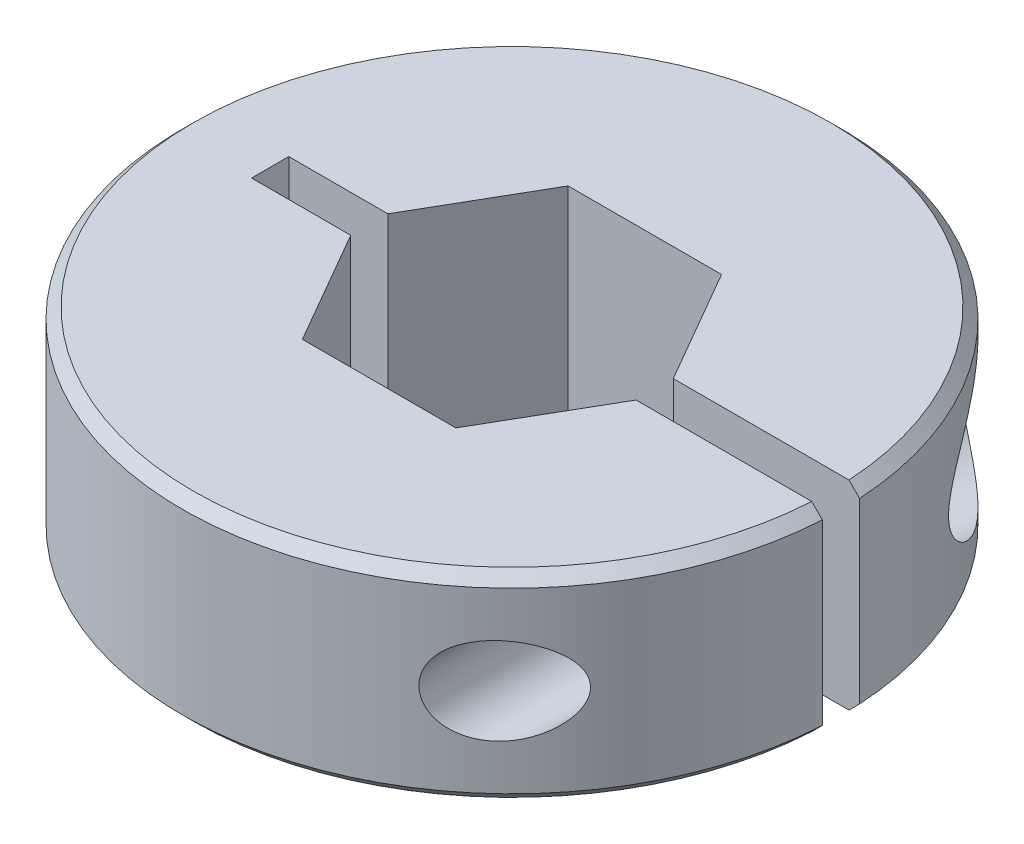
ISO-10303-21;
HEADER;
FILE_DESCRIPTION(('STEP AP214'),'2;1');
FILE_NAME('part.step','',(''),(''),'','','');
FILE_SCHEMA(('AUTOMOTIVE_DESIGN { 1 0 10303 214 1 1 1 1 }'));
ENDSEC;
DATA;
#1=APPLICATION_CONTEXT('core data for automotive mechanical design processes');
#2=APPLICATION_PROTOCOL_DEFINITION('international standard','automotive_design',2000,#1);
#3=PRODUCT_CONTEXT('',#1,'mechanical');
#4=PRODUCT('Part','Part','',(#3));
#5=PRODUCT_RELATED_PRODUCT_CATEGORY('part','',(#4));
#6=PRODUCT_DEFINITION_FORMATION('','',#4);
#7=PRODUCT_DEFINITION_CONTEXT('part definition',#1,'design');
#8=PRODUCT_DEFINITION('design','',#6,#7);
#9=PRODUCT_DEFINITION_SHAPE('','',#8);
#10=(LENGTH_UNIT() NAMED_UNIT(*) SI_UNIT(.MILLI.,.METRE.));
#11=(NAMED_UNIT(*) PLANE_ANGLE_UNIT() SI_UNIT($,.RADIAN.));
#12=(NAMED_UNIT(*) SI_UNIT($,.STERADIAN.) SOLID_ANGLE_UNIT());
#13=UNCERTAINTY_MEASURE_WITH_UNIT(LENGTH_MEASURE(1.E-05),#10,'distance_accuracy_value','');
#14=(GEOMETRIC_REPRESENTATION_CONTEXT(3) GLOBAL_UNCERTAINTY_ASSIGNED_CONTEXT((#13)) GLOBAL_UNIT_ASSIGNED_CONTEXT((#10,
#11,#12)) REPRESENTATION_CONTEXT('',''));
#15=CARTESIAN_POINT('',(0.,0.,0.));
#16=DIRECTION('',(0.,0.,1.));
#17=DIRECTION('',(1.,0.,0.));
#18=AXIS2_PLACEMENT_3D('',#15,#16,#17);
#19=CARTESIAN_POINT('',(10.7698872348561,4.7625,-4.95299999999999));
#20=DIRECTION('',(0.,0.,-1.));
#21=DIRECTION('',(-1.,0.,0.));
#22=AXIS2_PLACEMENT_3D('',#19,#20,#21);
#23=PLANE('',#22);
#24=CARTESIAN_POINT('',(10.7698872348561,4.7625,-4.95299999999999));
#25=DIRECTION('',(0.,0.,-1.));
#26=DIRECTION('',(-1.,0.,0.));
#27=AXIS2_PLACEMENT_3D('',#24,#25,#26);
#28=CIRCLE('',#27,2.0828);
#29=CARTESIAN_POINT('',(8.68708723485608,4.7625,-4.95299999999999));
#30=VERTEX_POINT('',#29);
#31=EDGE_CURVE('E366',#30,#30,#28,.F.);
#32=ORIENTED_EDGE('',*,*,#31,.T.);
#33=EDGE_LOOP('',(#32));
#34=FACE_BOUND('',#33,.T.);
#35=CARTESIAN_POINT('',(10.7698872348561,4.7625,-4.95299999999999));
#36=DIRECTION('',(0.,0.,-1.));
#37=DIRECTION('',(-1.,0.,0.));
#38=AXIS2_PLACEMENT_3D('',#35,#36,#37);
#39=CIRCLE('',#38,3.556);
#40=CARTESIAN_POINT('',(7.21388723485608,4.7625,-4.95299999999999));
#41=VERTEX_POINT('',#40);
#42=EDGE_CURVE('E18',#41,#41,#39,.T.);
#43=ORIENTED_EDGE('',*,*,#42,.T.);
#44=EDGE_LOOP('',(#43));
#45=FACE_BOUND('',#44,.T.);
#46=ADVANCED_FACE('F15',(#34,#45),#23,.T.);
#47=CARTESIAN_POINT('',(10.7698872348561,4.7625,-4.95299999999999));
#48=DIRECTION('',(0.,0.,-1.));
#49=DIRECTION('',(-1.,0.,0.));
#50=AXIS2_PLACEMENT_3D('',#47,#48,#49);
#51=CYLINDRICAL_SURFACE('',#50,3.556);
#52=ORIENTED_EDGE('',*,*,#42,.F.);
#53=EDGE_LOOP('',(#52));
#54=FACE_BOUND('',#53,.T.);
#55=CARTESIAN_POINT('',(14.3258872348561,4.7625,-6.53975985294472));
#56=CARTESIAN_POINT('',(14.3258802101327,4.85634541160308,-6.53977781823287));
#57=CARTESIAN_POINT('',(14.3221232292471,4.95030424142506,-6.54802444220115));
#58=CARTESIAN_POINT('',(14.3075403854795,5.13506724589043,-6.57982295084788));
#59=CARTESIAN_POINT('',(14.2966980026111,5.2258635244787,-6.60341060332637));
#60=CARTESIAN_POINT('',(14.2648298906135,5.42884942033144,-6.67202634115798));
#61=CARTESIAN_POINT('',(14.241717582217,5.53921812985933,-6.72137830213928));
#62=CARTESIAN_POINT('',(14.1877311128915,5.75013258396645,-6.83459686835309));
#63=CARTESIAN_POINT('',(14.1568374848652,5.85065280047014,-6.89849983784821));
#64=CARTESIAN_POINT('',(14.0924437791606,6.03298432738658,-7.02903324504136));
#65=CARTESIAN_POINT('',(14.0595097260254,6.11566187535202,-7.0947581831659));
#66=CARTESIAN_POINT('',(13.9895701736064,6.27455833367849,-7.23169053315644));
#67=CARTESIAN_POINT('',(13.9525612950944,6.35077178927176,-7.30290248045143));
#68=CARTESIAN_POINT('',(13.8749492461818,6.49761791287994,-7.44930661229992));
#69=CARTESIAN_POINT('',(13.8343390081347,6.56823906817771,-7.52450650153552));
#70=CARTESIAN_POINT('',(13.7499203733639,6.70439300444078,-7.67768578745681));
#71=CARTESIAN_POINT('',(13.7061108669219,6.76992400338089,-7.7556661437471));
#72=CARTESIAN_POINT('',(13.5756610431829,6.95206819386287,-7.98311673888825));
#73=CARTESIAN_POINT('',(13.4852602752041,7.06287792158442,-8.13510129764634));
#74=CARTESIAN_POINT('',(13.2948472891875,7.27039131057598,-8.44271083132734));
#75=CARTESIAN_POINT('',(13.1948277523302,7.36708408727628,-8.59833850904543));
#76=CARTESIAN_POINT('',(12.9855015613183,7.54733097869432,-8.91132662434683));
#77=CARTESIAN_POINT('',(12.8761822909971,7.63086679216558,-9.06868915537601));
#78=CARTESIAN_POINT('',(12.6486954291913,7.78476102571747,-9.38337396406768));
#79=CARTESIAN_POINT('',(12.5305303906523,7.85512322741985,-9.5406962402959));
#80=CARTESIAN_POINT('',(12.2803684735559,7.98496372268322,-9.86078267052133));
#81=CARTESIAN_POINT('',(12.1479974450252,8.04385354702655,-10.0234944992788));
#82=CARTESIAN_POINT('',(11.8742241429293,8.14582951431866,-10.3463578808173));
#83=CARTESIAN_POINT('',(11.7328196065666,8.18891167924842,-10.5065087794524));
#84=CARTESIAN_POINT('',(11.4419765112322,8.25759454702264,-10.8225052967782));
#85=CARTESIAN_POINT('',(11.2925602948798,8.28324138995105,-10.9783612231846));
#86=CARTESIAN_POINT('',(10.9864866313962,8.31523160616247,-11.2846593261545));
#87=CARTESIAN_POINT('',(10.8298338184708,8.32158716398237,-11.4351048605986));
#88=CARTESIAN_POINT('',(10.4661586887104,8.31137012677359,-11.7701141826685));
#89=CARTESIAN_POINT('',(10.2572299094152,8.2879398931793,-11.952549971263));
#90=CARTESIAN_POINT('',(9.94093117199582,8.22220411407008,-12.2145925982483));
#91=CARTESIAN_POINT('',(9.83503467746589,8.19520192874061,-12.2999896313674));
#92=CARTESIAN_POINT('',(9.62317637532075,8.13035964637057,-12.4664400391564));
#93=CARTESIAN_POINT('',(9.51721458016925,8.0925212072627,-12.5474940760489));
#94=CARTESIAN_POINT('',(9.23773090222422,7.9769942396801,-12.7558084686527));
#95=CARTESIAN_POINT('',(9.06498104706271,7.88937891244932,-12.8789273832935));
#96=CARTESIAN_POINT('',(8.81304787681505,7.73331152802878,-13.0514441629419));
#97=CARTESIAN_POINT('',(8.73023266669623,7.67715045689915,-13.1069453346054));
#98=CARTESIAN_POINT('',(8.56792721178135,7.55654901649832,-13.2136109068987));
#99=CARTESIAN_POINT('',(8.48843529494588,7.49211287873883,-13.2647775020027));
#100=CARTESIAN_POINT('',(8.33315341547218,7.35447221513299,-13.3628804881714));
#101=CARTESIAN_POINT('',(8.25739922141031,7.28120001721027,-13.4097786827516));
#102=CARTESIAN_POINT('',(8.11143066310858,7.12661434575874,-13.4985736305609));
#103=CARTESIAN_POINT('',(8.04121357149574,7.04530487613648,-13.5404728513841));
#104=CARTESIAN_POINT('',(7.90737910115857,6.87505974042199,-13.6190633700436));
#105=CARTESIAN_POINT('',(7.84376258835993,6.78612307651145,-13.655753984798));
#106=CARTESIAN_POINT('',(7.72422067571185,6.60129246281873,-13.7237257964545));
#107=CARTESIAN_POINT('',(7.66829377406391,6.50539987714818,-13.7550080499298));
#108=CARTESIAN_POINT('',(7.57209994669118,6.32089876366112,-13.8081644506484));
#109=CARTESIAN_POINT('',(7.53073801870365,6.23306049140412,-13.8307388776138));
#110=CARTESIAN_POINT('',(7.45506394565851,6.05345872816648,-13.8716753761884));
#111=CARTESIAN_POINT('',(7.42075082808777,5.96169578078054,-13.8900380289301));
#112=CARTESIAN_POINT('',(7.35971365562095,5.77515243900399,-13.9224750837775));
#113=CARTESIAN_POINT('',(7.33297456034102,5.68037844633708,-13.9365579886573));
#114=CARTESIAN_POINT('',(7.28738384372749,5.48846622830129,-13.9604514592805));
#115=CARTESIAN_POINT('',(7.26852856112471,5.39132912259834,-13.9702640082783));
#116=CARTESIAN_POINT('',(7.24050861719087,5.20576425952908,-13.9848045790064));
#117=CARTESIAN_POINT('',(7.2305354234247,5.11749071179964,-13.9899577106065));
#118=CARTESIAN_POINT('',(7.2172248258482,4.94031159408737,-13.9968291689679));
#119=CARTESIAN_POINT('',(7.21388723419033,4.85140604206748,-13.9985475929623));
#120=CARTESIAN_POINT('',(7.21388723553414,4.67195179789433,-13.9985476110114));
#121=CARTESIAN_POINT('',(7.21734926278969,4.58140308747079,-13.9967651380158));
#122=CARTESIAN_POINT('',(7.23115828417096,4.40093916435654,-13.9896359465601));
#123=CARTESIAN_POINT('',(7.24150793046234,4.31102420918497,-13.9842878551116));
#124=CARTESIAN_POINT('',(7.26898753870031,4.13241176431217,-13.9700237486178));
#125=CARTESIAN_POINT('',(7.2861256858743,4.04371587858107,-13.9611034262156));
#126=CARTESIAN_POINT('',(7.32698359584546,3.86825796671363,-13.9397039657145));
#127=CARTESIAN_POINT('',(7.35070587400067,3.78149669337648,-13.9272234674587));
#128=CARTESIAN_POINT('',(7.40438830197353,3.61074514482918,-13.8987574113662));
#129=CARTESIAN_POINT('',(7.43433349930276,3.52674877649907,-13.8827802505401));
#130=CARTESIAN_POINT('',(7.50014242460684,3.36185688051128,-13.8473377599988));
#131=CARTESIAN_POINT('',(7.53600833681294,3.28096251084538,-13.8278711427479));
#132=CARTESIAN_POINT('',(7.65184776953781,3.04383222389204,-13.7643195296919));
#133=CARTESIAN_POINT('',(7.74013650475195,2.89291883609898,-13.7150446815678));
#134=CARTESIAN_POINT('',(7.93749363512918,2.60519258233578,-13.6017987537623));
#135=CARTESIAN_POINT('',(8.0470510138712,2.46885980305838,-13.5374725844953));
#136=CARTESIAN_POINT('',(8.2807673635272,2.21712607174515,-13.3957849810104));
#137=CARTESIAN_POINT('',(8.40493038357992,2.10173094692881,-13.3184199294236));
#138=CARTESIAN_POINT('',(8.67522698965522,1.88317891124792,-13.1441278595841));
#139=CARTESIAN_POINT('',(8.82233027255559,1.78214829074975,-13.0460522387737));
#140=CARTESIAN_POINT('',(9.12312328605691,1.60596314647957,-12.8375084237637));
#141=CARTESIAN_POINT('',(9.27681719397595,1.53082531521556,-12.7270322958367));
#142=CARTESIAN_POINT('',(9.5422710715788,1.42297703834655,-12.528518964523));
#143=CARTESIAN_POINT('',(9.65355954695151,1.38427745464358,-12.4430058008556));
#144=CARTESIAN_POINT('',(9.87594765744132,1.3187455942787,-12.2672423634623));
#145=CARTESIAN_POINT('',(9.98704721780933,1.29191725220389,-12.1769905302291));
#146=CARTESIAN_POINT('',(10.2080911064823,1.24935182017681,-11.9922958498578));
#147=CARTESIAN_POINT('',(10.3180337647215,1.23362904337543,-11.8978477604071));
#148=CARTESIAN_POINT('',(10.5358233857399,1.21252490424971,-11.7054286637467));
#149=CARTESIAN_POINT('',(10.6436698123531,1.20714615410322,-11.6074567730327));
#150=CARTESIAN_POINT('',(10.8916930557678,1.20576866117929,-11.3757642543714));
#151=CARTESIAN_POINT('',(11.0308229562408,1.21344155421501,-11.240894457676));
#152=CARTESIAN_POINT('',(11.3031883938657,1.24404602719729,-10.9669859688471));
#153=CARTESIAN_POINT('',(11.4364218546941,1.26698293720511,-10.82794583667));
#154=CARTESIAN_POINT('',(11.6965108776215,1.32675521317298,-10.5464650170899));
#155=CARTESIAN_POINT('',(11.8233542503126,1.3636160806688,-10.404018542138));
#156=CARTESIAN_POINT('',(12.0699302638544,1.45008490416835,-10.1169212785489));
#157=CARTESIAN_POINT('',(12.1896637825458,1.49969128246165,-9.972270764823));
#158=CARTESIAN_POINT('',(12.4246139044458,1.61219837791168,-9.67805673756421));
#159=CARTESIAN_POINT('',(12.5396459395563,1.67539715104928,-9.52846011251046));
#160=CARTESIAN_POINT('',(12.7617529978898,1.81381579443926,-9.22886453170507));
#161=CARTESIAN_POINT('',(12.8688261328908,1.88903850407856,-9.07886548917138));
#162=CARTESIAN_POINT('',(13.0744553641225,2.05119024025583,-8.78014236332775));
#163=CARTESIAN_POINT('',(13.173035931681,2.13808365008095,-8.63141581069281));
#164=CARTESIAN_POINT('',(13.3616843960615,2.32420365222344,-8.3363958685354));
#165=CARTESIAN_POINT('',(13.451757264645,2.42342296200188,-8.19010109962815));
#166=CARTESIAN_POINT('',(13.6116195924323,2.62154532753919,-7.9211412543091));
#167=CARTESIAN_POINT('',(13.6825181018136,2.71876930471927,-7.79790148777794));
#168=CARTESIAN_POINT('',(13.8170094573764,2.9252659579734,-7.55703256699273));
#169=CARTESIAN_POINT('',(13.8805892465248,3.03455950675444,-7.439413652724));
#170=CARTESIAN_POINT('',(13.9696829357965,3.20983294004436,-7.26991206491311));
#171=CARTESIAN_POINT('',(13.998474219947,3.27050842058356,-7.21428219749727));
#172=CARTESIAN_POINT('',(14.053522509489,3.39590709581087,-7.10645435860726));
#173=CARTESIAN_POINT('',(14.0797786450469,3.4606316673168,-7.05425756699864));
#174=CARTESIAN_POINT('',(14.1540483459128,3.66119550007852,-6.90467874614068));
#175=CARTESIAN_POINT('',(14.1978535847609,3.80397430634081,-6.81374939024184));
#176=CARTESIAN_POINT('',(14.2528665467019,4.04043273554549,-6.69757154936107));
#177=CARTESIAN_POINT('',(14.2698701639585,4.1272661016415,-6.66118560870885));
#178=CARTESIAN_POINT('',(14.2976374490466,4.30617023176898,-6.60137540914532));
#179=CARTESIAN_POINT('',(14.3084204881001,4.3982237456726,-6.5779109225986));
#180=CARTESIAN_POINT('',(14.3189776006577,4.53642419510442,-6.55487957959468));
#181=CARTESIAN_POINT('',(14.3215598785465,4.58139897106679,-6.54923250575828));
#182=CARTESIAN_POINT('',(14.3250166647714,4.67174023972008,-6.54166770748385));
#183=CARTESIAN_POINT('',(14.3258906327239,4.71710685180244,-6.53975116311137));
#184=CARTESIAN_POINT('',(14.3258872348561,4.7625,-6.53975985294472));
#185=B_SPLINE_CURVE_WITH_KNOTS('',3,(#55,#56,#57,#58,#59,#60,#61,#62,#63,#64,#65,#66,#67,#68,
#69,#70,#71,#72,#73,#74,#75,#76,#77,#78,#79,#80,#81,#82,#83,#84,#85,#86,#87,#88,#89,#90,#91,#92,
#93,#94,#95,#96,#97,#98,#99,#100,#101,#102,#103,#104,#105,#106,#107,#108,#109,#110,#111,#112,
#113,#114,#115,#116,#117,#118,#119,#120,#121,#122,#123,#124,#125,#126,#127,#128,#129,#130,#131,
#132,#133,#134,#135,#136,#137,#138,#139,#140,#141,#142,#143,#144,#145,#146,#147,#148,#149,#150,
#151,#152,#153,#154,#155,#156,#157,#158,#159,#160,#161,#162,#163,#164,#165,#166,#167,#168,#169,
#170,#171,#172,#173,#174,#175,#176,#177,#178,#179,#180,#181,#182,#183,#184),.UNSPECIFIED.,.T.,
.F.,(4,2,2,2,2,2,2,2,2,2,2,2,2,2,2,2,2,2,2,2,2,2,2,2,2,2,2,2,2,2,2,2,2,2,2,2,2,2,2,2,2,2,2,2,2,
2,2,2,2,2,2,2,2,2,2,2,2,2,2,2,2,2,2,2,4),(0.,0.281333601056524,0.563325497773301,
0.930484951610502,1.29857224067616,1.63000003475275,1.96170478006464,2.2940755433234,
2.62656214747412,3.25168139613634,3.87728011251421,4.50374149016518,5.1300227589346,
5.78287682902516,6.43589507823465,7.08717840995805,7.73805029999987,8.56967834518819,
8.98533225696251,9.40092260817414,10.0861557152519,10.4290848834885,10.7718393856522,
11.1174090967901,11.4628075157551,11.8082511901751,12.1536273025388,12.4522671756997,
12.7508658182803,13.0488672831718,13.3467302010533,13.6133748194642,13.8800118893135,
14.1515739421068,14.4232406238874,14.6952358694689,14.9673351696913,15.2387880740547,
15.5103413457583,16.0527226675481,16.6094879885838,17.1664080277032,17.7749576039121,
18.3838987678215,18.8201103318059,19.2564663650232,19.6933837644874,20.130411484256,
20.7113367344511,21.2924649451811,21.8746626855737,22.4567883929736,23.0532899301832,
23.6499325366391,24.2447940124759,24.8393056817929,25.3555252022738,25.8726518650046,
26.1340798938323,26.3955973047107,26.9161427152879,27.2022580581599,27.4874775445238,
27.6235159493337,27.7595973797154),.UNSPECIFIED.);
#186=CARTESIAN_POINT('',(14.3258872348561,4.7625,-6.53975985294472));
#187=VERTEX_POINT('',#186);
#188=EDGE_CURVE('E212',#187,#187,#185,.T.);
#189=ORIENTED_EDGE('',*,*,#188,.F.);
#190=EDGE_LOOP('',(#189));
#191=FACE_BOUND('',#190,.T.);
#192=ADVANCED_FACE('F379',(#54,#191),#51,.F.);
#193=CARTESIAN_POINT('',(0.,0.508000000000022,0.));
#194=DIRECTION('',(0.,1.,0.));
#195=DIRECTION('',(0.,0.,1.));
#196=AXIS2_PLACEMENT_3D('',#193,#194,#195);
#197=CONICAL_SURFACE('',#196,15.748,0.785398163397448);
#198=CARTESIAN_POINT('',(15.2140487379264,0.,0.889000000000003));
#199=CARTESIAN_POINT('',(15.2988574469444,0.0846643700195372,0.889000000000003));
#200=CARTESIAN_POINT('',(15.383665009531,0.169329888362768,0.889000000000003));
#201=CARTESIAN_POINT('',(15.5532778418409,0.33866322169611,0.889000000000003));
#202=CARTESIAN_POINT('',(15.6380831115642,0.42333103668622,0.889000000000003));
#203=CARTESIAN_POINT('',(15.7228872348561,0.508000000000023,0.889000000000003));
#204=B_SPLINE_CURVE_WITH_KNOTS('',3,(#198,#199,#200,#201,#202,#203),.UNSPECIFIED.,.F.,.F.,(4,2,
4),(0.,0.359506820538772,0.719013641075381),.UNSPECIFIED.);
#205=CARTESIAN_POINT('',(15.2140487379264,0.,0.889000000000003));
#206=VERTEX_POINT('',#205);
#207=CARTESIAN_POINT('',(15.7228872348561,0.508000000000024,0.889000000000003));
#208=VERTEX_POINT('',#207);
#209=EDGE_CURVE('E134',#206,#208,#204,.T.);
#210=ORIENTED_EDGE('',*,*,#209,.T.);
#211=CARTESIAN_POINT('',(0.,0.508000000000026,0.));
#212=DIRECTION('',(0.,-1.,0.));
#213=DIRECTION('',(0.,0.,-1.));
#214=AXIS2_PLACEMENT_3D('',#211,#212,#213);
#215=CIRCLE('',#214,15.748);
#216=CARTESIAN_POINT('',(15.7228872348561,0.508000000000022,-0.888999999999997));
#217=VERTEX_POINT('',#216);
#218=EDGE_CURVE('E113',#217,#208,#215,.F.);
#219=ORIENTED_EDGE('',*,*,#218,.F.);
#220=CARTESIAN_POINT('',(15.7228872348561,0.508000000000022,-0.888999999999997));
#221=CARTESIAN_POINT('',(15.6380831115642,0.423331036686218,-0.888999999999997));
#222=CARTESIAN_POINT('',(15.5532778418409,0.338663221696107,-0.888999999999997));
#223=CARTESIAN_POINT('',(15.383665009531,0.169329888362766,-0.888999999999997));
#224=CARTESIAN_POINT('',(15.2988574469444,0.0846643700195348,-0.888999999999997));
#225=CARTESIAN_POINT('',(15.2140487379264,0.,-0.888999999999997));
#226=B_SPLINE_CURVE_WITH_KNOTS('',3,(#220,#221,#222,#223,#224,#225),.UNSPECIFIED.,.F.,.F.,(4,2,
4),(0.,0.359506820536611,0.719013641075383),.UNSPECIFIED.);
#227=CARTESIAN_POINT('',(15.2140487379264,0.,-0.888999999999997));
#228=VERTEX_POINT('',#227);
#229=EDGE_CURVE('E129',#217,#228,#226,.T.);
#230=ORIENTED_EDGE('',*,*,#229,.T.);
#231=CARTESIAN_POINT('',(0.,0.,0.));
#232=DIRECTION('',(0.,1.,0.));
#233=DIRECTION('',(0.,0.,1.));
#234=AXIS2_PLACEMENT_3D('',#231,#232,#233);
#235=CIRCLE('',#234,15.24);
#236=EDGE_CURVE('E119',#228,#206,#235,.T.);
#237=ORIENTED_EDGE('',*,*,#236,.T.);
#238=EDGE_LOOP('',(#210,#219,#230,#237));
#239=FACE_BOUND('',#238,.T.);
#240=ADVANCED_FACE('F130',(#239),#197,.T.);
#241=CARTESIAN_POINT('',(10.769887234856,4.7625,22.352));
#242=DIRECTION('',(0.,0.,-1.));
#243=DIRECTION('',(-1.,0.,0.));
#244=AXIS2_PLACEMENT_3D('',#241,#242,#243);
#245=CYLINDRICAL_SURFACE('',#244,2.0828);
#246=CARTESIAN_POINT('',(10.7698872348561,4.7625,-0.88899999999999));
#247=DIRECTION('',(0.,0.,-1.));
#248=DIRECTION('',(-1.,0.,0.));
#249=AXIS2_PLACEMENT_3D('',#246,#247,#248);
#250=CIRCLE('',#249,2.0828);
#251=CARTESIAN_POINT('',(8.68708723485607,4.7625,-0.888999999999993));
#252=VERTEX_POINT('',#251);
#253=EDGE_CURVE('E127',#252,#252,#250,.F.);
#254=ORIENTED_EDGE('',*,*,#253,.T.);
#255=EDGE_LOOP('',(#254));
#256=FACE_BOUND('',#255,.T.);
#257=ORIENTED_EDGE('',*,*,#31,.F.);
#258=EDGE_LOOP('',(#257));
#259=FACE_BOUND('',#258,.T.);
#260=ADVANCED_FACE('F378',(#256,#259),#245,.F.);
#261=CARTESIAN_POINT('',(10.769887234856,4.7625,22.352));
#262=DIRECTION('',(0.,0.,-1.));
#263=DIRECTION('',(-1.,0.,0.));
#264=AXIS2_PLACEMENT_3D('',#261,#262,#263);
#265=CYLINDRICAL_SURFACE('',#264,2.0828);
#266=CARTESIAN_POINT('',(10.7698872348561,4.7625,0.889000000000011));
#267=DIRECTION('',(0.,0.,-1.));
#268=DIRECTION('',(-1.,0.,0.));
#269=AXIS2_PLACEMENT_3D('',#266,#267,#268);
#270=CIRCLE('',#269,2.0828);
#271=CARTESIAN_POINT('',(8.68708723485607,4.7625,0.889000000000009));
#272=VERTEX_POINT('',#271);
#273=EDGE_CURVE('E170',#272,#272,#270,.T.);
#274=ORIENTED_EDGE('',*,*,#273,.T.);
#275=EDGE_LOOP('',(#274));
#276=FACE_BOUND('',#275,.T.);
#277=CARTESIAN_POINT('',(12.8526872348561,4.76249999999999,9.09988652912596));
#278=CARTESIAN_POINT('',(12.8526849657785,4.67721487433345,9.09989015730127));
#279=CARTESIAN_POINT('',(12.8473850679749,4.59191743130262,9.10738914885516));
#280=CARTESIAN_POINT('',(12.8268757677912,4.42490349779867,9.13624937123116));
#281=CARTESIAN_POINT('',(12.8116480494562,4.34319392461333,9.15763622364334));
#282=CARTESIAN_POINT('',(12.7731460874511,4.18679862866071,9.21125937839647));
#283=CARTESIAN_POINT('',(12.749974952972,4.11203778725972,9.24335652059155));
#284=CARTESIAN_POINT('',(12.6971841581248,3.96915868093151,9.3157412278843));
#285=CARTESIAN_POINT('',(12.667562047379,3.90104295439965,9.35603190487755));
#286=CARTESIAN_POINT('',(12.5821659929288,3.72903619671997,9.47082194764619));
#287=CARTESIAN_POINT('',(12.5219448615974,3.63082406313881,9.55048100626254));
#288=CARTESIAN_POINT('',(12.3913735790584,3.45052608072542,9.71930313364344));
#289=CARTESIAN_POINT('',(12.3209920143448,3.36849218393896,9.80849544623571));
#290=CARTESIAN_POINT('',(12.1903779662395,3.23717446798516,9.97006755693421));
#291=CARTESIAN_POINT('',(12.1318065562036,3.18476800611778,10.0412976765771));
#292=CARTESIAN_POINT('',(12.0107236674112,3.08786580098822,10.1858190335112));
#293=CARTESIAN_POINT('',(11.9482102729086,3.04337394487003,10.2591112632248));
#294=CARTESIAN_POINT('',(11.8196989276694,2.96201826731525,10.4069117753942));
#295=CARTESIAN_POINT('',(11.753699639284,2.92515740121988,10.4814205169753));
#296=CARTESIAN_POINT('',(11.6185971914304,2.85897569981991,10.6309871353414));
#297=CARTESIAN_POINT('',(11.5494928507538,2.82965776297729,10.7060452118553));
#298=CARTESIAN_POINT('',(11.3343476285718,2.75174520078725,10.9351058654212));
#299=CARTESIAN_POINT('',(11.1837704455942,2.71526999219497,11.0891799482674));
#300=CARTESIAN_POINT('',(10.8742004604569,2.67648722230348,11.3929003759898));
#301=CARTESIAN_POINT('',(10.7152182920593,2.67413747768004,11.5425519591022));
#302=CARTESIAN_POINT('',(10.4273387860288,2.70410307982674,11.8025191389458));
#303=CARTESIAN_POINT('',(10.2991766877212,2.72920407321781,11.9144687115806));
#304=CARTESIAN_POINT('',(10.0439408644334,2.80577892270206,12.13039736427));
#305=CARTESIAN_POINT('',(9.91686600167435,2.85722054200997,12.2343860088434));
#306=CARTESIAN_POINT('',(9.69452671838212,2.97530094960732,12.4109443030153));
#307=CARTESIAN_POINT('',(9.5980944442421,3.03663936641014,12.4855775426182));
#308=CARTESIAN_POINT('',(9.41281538424179,3.17821455196851,12.6258406497729));
#309=CARTESIAN_POINT('',(9.32395956874259,3.25842838364118,12.6914812929957));
#310=CARTESIAN_POINT('',(9.17174116425462,3.42294142277123,12.8017988028076));
#311=CARTESIAN_POINT('',(9.10658331696253,3.50444939263208,12.8481488409074));
#312=CARTESIAN_POINT('',(8.98756442859534,3.6796362908711,12.9316850097709));
#313=CARTESIAN_POINT('',(8.93370506366377,3.77331702175952,12.9688697809991));
#314=CARTESIAN_POINT('',(8.83993695948163,3.97166338067582,13.0329698826154));
#315=CARTESIAN_POINT('',(8.80012463839546,4.07639875428507,13.0598143486735));
#316=CARTESIAN_POINT('',(8.75324978441499,4.23865339258065,13.0912361340024));
#317=CARTESIAN_POINT('',(8.73976955965578,4.29356337220615,13.1002332383043));
#318=CARTESIAN_POINT('',(8.71727294203008,4.40468210033675,13.1152141752231));
#319=CARTESIAN_POINT('',(8.70825376387673,4.46089001545986,13.1211998880642));
#320=CARTESIAN_POINT('',(8.69674282101404,4.55805248110241,13.1288308903213));
#321=CARTESIAN_POINT('',(8.6931259632303,4.59882009310388,13.1312252449979));
#322=CARTESIAN_POINT('',(8.68829667247845,4.68055135699638,13.1344208194237));
#323=CARTESIAN_POINT('',(8.68708419332885,4.72151500510695,13.1352220697721));
#324=CARTESIAN_POINT('',(8.68709479315966,4.86434917419658,13.1352168365723));
#325=CARTESIAN_POINT('',(8.69460868061666,4.96633017336223,13.1302557886596));
#326=CARTESIAN_POINT('',(8.72426633821953,5.16728399460584,13.1105675409103));
#327=CARTESIAN_POINT('',(8.74643833334946,5.26625062700242,13.0958214993317));
#328=CARTESIAN_POINT('',(8.80407699753154,5.45793035577137,13.057140621899));
#329=CARTESIAN_POINT('',(8.83949732619442,5.55066393580128,13.0332378078865));
#330=CARTESIAN_POINT('',(8.92182173288028,5.72804586521482,12.9770209621949));
#331=CARTESIAN_POINT('',(8.96872362029596,5.81269575263716,12.9447085349416));
#332=CARTESIAN_POINT('',(9.07447191225792,5.97641135891996,12.8708123603317));
#333=CARTESIAN_POINT('',(9.13379203130166,6.0549982325124,12.828851032466));
#334=CARTESIAN_POINT('',(9.26034758845663,6.20079007154361,12.7377999735005));
#335=CARTESIAN_POINT('',(9.32758587089419,6.26799092567915,12.6887076793603));
#336=CARTESIAN_POINT('',(9.47820134936393,6.3998946156388,12.5766944368959));
#337=CARTESIAN_POINT('',(9.56248957397618,6.46272806581436,12.5128031064949));
#338=CARTESIAN_POINT('',(9.73566435951628,6.57330607946558,12.3785462112302));
#339=CARTESIAN_POINT('',(9.82455503629973,6.6210368560248,12.3081748060499));
#340=CARTESIAN_POINT('',(10.0490357856372,6.72213311001151,12.1262590568233));
#341=CARTESIAN_POINT('',(10.1860421300535,6.76667381693734,12.011521352593));
#342=CARTESIAN_POINT('',(10.4595051304799,6.82681253615639,11.7741759200852));
#343=CARTESIAN_POINT('',(10.595960796807,6.84237146071909,11.6515577935757));
#344=CARTESIAN_POINT('',(10.8667189941457,6.84751556094894,11.3995029297018));
#345=CARTESIAN_POINT('',(11.0009564000633,6.83669869708672,11.2699904556279));
#346=CARTESIAN_POINT('',(11.2627721773721,6.79050971665929,11.0083489315533));
#347=CARTESIAN_POINT('',(11.3903424361735,6.75510840082997,10.8762169518103));
#348=CARTESIAN_POINT('',(11.5883472391988,6.67942246150939,10.6640425246404));
#349=CARTESIAN_POINT('',(11.6615701409844,6.64649648165814,10.5838919786591));
#350=CARTESIAN_POINT('',(11.8044314372396,6.57199407465513,10.4243156059259));
#351=CARTESIAN_POINT('',(11.8740683601665,6.53041413099749,10.3448900875241));
#352=CARTESIAN_POINT('',(12.0091160089648,6.43851580677367,10.1878038521262));
#353=CARTESIAN_POINT('',(12.0745343626227,6.38821384143027,10.1101401244262));
#354=CARTESIAN_POINT('',(12.200633306139,6.27841748895369,9.95760141971698));
#355=CARTESIAN_POINT('',(12.2613179671042,6.21893113482775,9.88272407598555));
#356=CARTESIAN_POINT('',(12.3780242266411,6.0890358503295,9.73616564952523));
#357=CARTESIAN_POINT('',(12.4339608037738,6.01847446928818,9.664550552482));
#358=CARTESIAN_POINT('',(12.5386647458202,5.86613500091714,9.5283124245007));
#359=CARTESIAN_POINT('',(12.5874413246117,5.78437159578339,9.46368043611273));
#360=CARTESIAN_POINT('',(12.6663923391199,5.62700372227921,9.35764067457881));
#361=CARTESIAN_POINT('',(12.698324555151,5.55367497659437,9.31420107592099));
#362=CARTESIAN_POINT('',(12.7546284648561,5.3993506014596,9.23694979385347));
#363=CARTESIAN_POINT('',(12.7790089044199,5.31836398379192,9.20312697677835));
#364=CARTESIAN_POINT('',(12.8160066985517,5.1591789350814,9.15152371323349));
#365=CARTESIAN_POINT('',(12.8296299651249,5.08167029021318,9.1323784870118));
#366=CARTESIAN_POINT('',(12.8479646915667,4.92360829315203,9.10656744218702));
#367=CARTESIAN_POINT('',(12.8526893782084,4.84305964168429,9.09988310198082));
#368=CARTESIAN_POINT('',(12.8526872348561,4.76249999999999,9.09988652912596));
#369=B_SPLINE_CURVE_WITH_KNOTS('',3,(#277,#278,#279,#280,#281,#282,#283,#284,#285,#286,#287,
#288,#289,#290,#291,#292,#293,#294,#295,#296,#297,#298,#299,#300,#301,#302,#303,#304,#305,#306,
#307,#308,#309,#310,#311,#312,#313,#314,#315,#316,#317,#318,#319,#320,#321,#322,#323,#324,#325,
#326,#327,#328,#329,#330,#331,#332,#333,#334,#335,#336,#337,#338,#339,#340,#341,#342,#343,#344,
#345,#346,#347,#348,#349,#350,#351,#352,#353,#354,#355,#356,#357,#358,#359,#360,#361,#362,#363,
#364,#365,#366,#367,#368),.UNSPECIFIED.,.T.,.F.,(4,2,2,2,2,2,2,2,2,2,2,2,2,2,2,2,2,2,2,2,2,2,2,
2,2,2,2,2,2,2,2,2,2,2,2,2,2,2,2,2,2,2,2,2,2,4),(0.,0.255429945144551,0.511332474695327,
0.764031719665721,1.0168271193819,1.43467420618712,1.85384199615098,2.17165316529059,
2.48961999440878,2.80770973677505,3.12592152703612,3.77853328514328,4.43033826506661,
4.94452273206227,5.45807941681417,5.86603010952289,6.2734876044479,6.61460880867877,
6.95578058292145,7.29925055884435,7.47078574004859,7.64221368639682,7.76510677736735,
7.88799750787768,8.19338535656605,8.49936296562259,8.80428017701253,9.10913925744631,
9.42897981012341,9.74893560694054,10.1166394104051,10.4846779210059,11.0341750567324,
11.5844127641539,12.1430898899268,12.7024317009792,13.0424347692786,13.3825762672421,
13.7220844181505,14.0612972874523,14.4056725662771,14.7496007242765,15.0217531506765,
15.2935892022092,15.5352257185396,15.7765027840943),.UNSPECIFIED.);
#370=CARTESIAN_POINT('',(12.8526872348561,4.76249999999999,9.09988652912596));
#371=VERTEX_POINT('',#370);
#372=EDGE_CURVE('E176',#371,#371,#369,.T.);
#373=ORIENTED_EDGE('',*,*,#372,.F.);
#374=EDGE_LOOP('',(#373));
#375=FACE_BOUND('',#374,.T.);
#376=ADVANCED_FACE('F216',(#276,#375),#265,.F.);
#377=CARTESIAN_POINT('',(0.,9.525,0.));
#378=DIRECTION('',(0.,-1.,0.));
#379=DIRECTION('',(0.,0.,-1.));
#380=AXIS2_PLACEMENT_3D('',#377,#378,#379);
#381=CYLINDRICAL_SURFACE('',#380,15.748);
#382=ORIENTED_EDGE('',*,*,#218,.T.);
#383=DIRECTION('',(0.,1.,0.));
#384=VECTOR('',#383,1.);
#385=CARTESIAN_POINT('',(15.7228872348561,0.,0.889000000000003));
#386=LINE('',#385,#384);
#387=CARTESIAN_POINT('',(15.7228872348561,9.01700000000002,0.889000000000003));
#388=VERTEX_POINT('',#387);
#389=EDGE_CURVE('E158',#208,#388,#386,.T.);
#390=ORIENTED_EDGE('',*,*,#389,.T.);
#391=CARTESIAN_POINT('',(0.,9.01700000000002,0.));
#392=DIRECTION('',(0.,-1.,0.));
#393=DIRECTION('',(0.,0.,-1.));
#394=AXIS2_PLACEMENT_3D('',#391,#392,#393);
#395=CIRCLE('',#394,15.748);
#396=CARTESIAN_POINT('',(15.7228872348561,9.01700000000002,-0.888999999999997));
#397=VERTEX_POINT('',#396);
#398=EDGE_CURVE('E144',#397,#388,#395,.F.);
#399=ORIENTED_EDGE('',*,*,#398,.F.);
#400=DIRECTION('',(0.,1.,0.));
#401=VECTOR('',#400,1.);
#402=CARTESIAN_POINT('',(15.7228872348561,0.,-0.888999999999997));
#403=LINE('',#402,#401);
#404=EDGE_CURVE('E141',#397,#217,#403,.F.);
#405=ORIENTED_EDGE('',*,*,#404,.T.);
#406=EDGE_LOOP('',(#382,#390,#399,#405));
#407=FACE_BOUND('',#406,.T.);
#408=ORIENTED_EDGE('',*,*,#372,.T.);
#409=EDGE_LOOP('',(#408));
#410=FACE_BOUND('',#409,.T.);
#411=ORIENTED_EDGE('',*,*,#188,.T.);
#412=EDGE_LOOP('',(#411));
#413=FACE_BOUND('',#412,.T.);
#414=ADVANCED_FACE('F219',(#407,#410,#413),#381,.T.);
#415=CARTESIAN_POINT('',(0.,0.,0.));
#416=DIRECTION('',(0.,1.,0.));
#417=DIRECTION('',(0.,0.,1.));
#418=AXIS2_PLACEMENT_3D('',#415,#416,#417);
#419=PLANE('',#418);
#420=ORIENTED_EDGE('',*,*,#236,.F.);
#421=DIRECTION('',(-1.,0.,0.));
#422=VECTOR('',#421,1.);
#423=CARTESIAN_POINT('',(15.7228872348561,0.,-0.888999999999997));
#424=LINE('',#423,#422);
#425=CARTESIAN_POINT('',(6.81908402939866,0.,-0.888999999999998));
#426=VERTEX_POINT('',#425);
#427=EDGE_CURVE('E123',#228,#426,#424,.T.);
#428=ORIENTED_EDGE('',*,*,#427,.T.);
#429=DIRECTION('',(0.499999999999998,0.,0.86602540378444));
#430=VECTOR('',#429,1.);
#431=CARTESIAN_POINT('',(7.33234841870825,0.,0.));
#432=LINE('',#431,#430);
#433=CARTESIAN_POINT('',(3.66617420935413,0.,-6.34999999999999));
#434=VERTEX_POINT('',#433);
#435=EDGE_CURVE('E152',#434,#426,#432,.T.);
#436=ORIENTED_EDGE('',*,*,#435,.F.);
#437=DIRECTION('',(1.,0.,0.));
#438=VECTOR('',#437,1.);
#439=CARTESIAN_POINT('',(3.66617420935414,0.,-6.34999999999999));
#440=LINE('',#439,#438);
#441=CARTESIAN_POINT('',(-3.66617420935412,0.,-6.35));
#442=VERTEX_POINT('',#441);
#443=EDGE_CURVE('E306',#442,#434,#440,.T.);
#444=ORIENTED_EDGE('',*,*,#443,.F.);
#445=DIRECTION('',(0.5,0.,-0.866025403784438));
#446=VECTOR('',#445,1.);
#447=CARTESIAN_POINT('',(-3.66617420935412,0.,-6.35));
#448=LINE('',#447,#446);
#449=CARTESIAN_POINT('',(-6.81908402939867,0.,-0.888999999999996));
#450=VERTEX_POINT('',#449);
#451=EDGE_CURVE('E308',#450,#442,#448,.T.);
#452=ORIENTED_EDGE('',*,*,#451,.F.);
#453=DIRECTION('',(-1.,0.,0.));
#454=VECTOR('',#453,1.);
#455=CARTESIAN_POINT('',(15.7228872348561,0.,-0.888999999999997));
#456=LINE('',#455,#454);
#457=CARTESIAN_POINT('',(-11.557,0.,-0.888999999999997));
#458=VERTEX_POINT('',#457);
#459=EDGE_CURVE('E319',#450,#458,#456,.T.);
#460=ORIENTED_EDGE('',*,*,#459,.T.);
#461=DIRECTION('',(0.,0.,1.));
#462=VECTOR('',#461,1.);
#463=CARTESIAN_POINT('',(-11.557,0.,-0.888999999999997));
#464=LINE('',#463,#462);
#465=CARTESIAN_POINT('',(-11.557,0.,0.889000000000003));
#466=VERTEX_POINT('',#465);
#467=EDGE_CURVE('E323',#458,#466,#464,.T.);
#468=ORIENTED_EDGE('',*,*,#467,.T.);
#469=DIRECTION('',(1.,0.,0.));
#470=VECTOR('',#469,1.);
#471=CARTESIAN_POINT('',(16.4125188310913,0.,0.889000000000003));
#472=LINE('',#471,#470);
#473=CARTESIAN_POINT('',(-6.81908402939867,0.,0.889000000000003));
#474=VERTEX_POINT('',#473);
#475=EDGE_CURVE('E327',#466,#474,#472,.T.);
#476=ORIENTED_EDGE('',*,*,#475,.T.);
#477=DIRECTION('',(-0.5,0.,-0.866025403784438));
#478=VECTOR('',#477,1.);
#479=CARTESIAN_POINT('',(-7.33234841870825,0.,0.));
#480=LINE('',#479,#478);
#481=CARTESIAN_POINT('',(-3.66617420935412,0.,6.35));
#482=VERTEX_POINT('',#481);
#483=EDGE_CURVE('E329',#482,#474,#480,.T.);
#484=ORIENTED_EDGE('',*,*,#483,.F.);
#485=DIRECTION('',(-1.,0.,0.));
#486=VECTOR('',#485,1.);
#487=CARTESIAN_POINT('',(-3.66617420935412,0.,6.35));
#488=LINE('',#487,#486);
#489=CARTESIAN_POINT('',(3.66617420935411,0.,6.35000000000001));
#490=VERTEX_POINT('',#489);
#491=EDGE_CURVE('E165',#490,#482,#488,.T.);
#492=ORIENTED_EDGE('',*,*,#491,.F.);
#493=DIRECTION('',(-0.500000000000002,0.,0.866025403784437));
#494=VECTOR('',#493,1.);
#495=CARTESIAN_POINT('',(3.66617420935411,0.,6.35000000000001));
#496=LINE('',#495,#494);
#497=CARTESIAN_POINT('',(6.81908402939868,0.,0.889000000000001));
#498=VERTEX_POINT('',#497);
#499=EDGE_CURVE('E162',#498,#490,#496,.T.);
#500=ORIENTED_EDGE('',*,*,#499,.F.);
#501=DIRECTION('',(1.,0.,0.));
#502=VECTOR('',#501,1.);
#503=CARTESIAN_POINT('',(16.4125188310913,0.,0.889000000000003));
#504=LINE('',#503,#502);
#505=EDGE_CURVE('E126',#498,#206,#504,.T.);
#506=ORIENTED_EDGE('',*,*,#505,.T.);
#507=EDGE_LOOP('',(#420,#428,#436,#444,#452,#460,#468,#476,#484,#492,#500,#506));
#508=FACE_BOUND('',#507,.T.);
#509=ADVANCED_FACE('F120',(#508),#419,.F.);
#510=CARTESIAN_POINT('',(15.7228872348561,0.,-0.888999999999997));
#511=DIRECTION('',(0.,0.,-1.));
#512=DIRECTION('',(-1.,0.,0.));
#513=AXIS2_PLACEMENT_3D('',#510,#511,#512);
#514=PLANE('',#513);
#515=ORIENTED_EDGE('',*,*,#229,.F.);
#516=ORIENTED_EDGE('',*,*,#404,.F.);
#517=CARTESIAN_POINT('',(15.2140487379264,9.525,-0.888999999999997));
#518=CARTESIAN_POINT('',(15.2988574469444,9.44033562998047,-0.888999999999997));
#519=CARTESIAN_POINT('',(15.3836650095311,9.35567011163725,-0.888999999999997));
#520=CARTESIAN_POINT('',(15.5532778418409,9.18633677830392,-0.888999999999997));
#521=CARTESIAN_POINT('',(15.6380831115642,9.10166896331382,-0.888999999999997));
#522=CARTESIAN_POINT('',(15.7228872348561,9.01700000000002,-0.888999999999997));
#523=B_SPLINE_CURVE_WITH_KNOTS('',3,(#517,#518,#519,#520,#521,#522),.UNSPECIFIED.,.F.,.F.,(4,2,
4),(0.,0.359506820538739,0.719013641075316),.UNSPECIFIED.);
#524=CARTESIAN_POINT('',(15.2140487379264,9.525,-0.888999999999997));
#525=VERTEX_POINT('',#524);
#526=EDGE_CURVE('E140',#525,#397,#523,.T.);
#527=ORIENTED_EDGE('',*,*,#526,.F.);
#528=DIRECTION('',(1.,0.,0.));
#529=VECTOR('',#528,1.);
#530=CARTESIAN_POINT('',(0.,9.525,-0.888999999999997));
#531=LINE('',#530,#529);
#532=CARTESIAN_POINT('',(6.81908402939866,9.525,-0.888999999999997));
#533=VERTEX_POINT('',#532);
#534=EDGE_CURVE('E154',#533,#525,#531,.T.);
#535=ORIENTED_EDGE('',*,*,#534,.F.);
#536=DIRECTION('',(0.,1.,0.));
#537=VECTOR('',#536,1.);
#538=CARTESIAN_POINT('',(6.81908402939866,9.525,-0.888999999999998));
#539=LINE('',#538,#537);
#540=EDGE_CURVE('E138',#426,#533,#539,.T.);
#541=ORIENTED_EDGE('',*,*,#540,.F.);
#542=ORIENTED_EDGE('',*,*,#427,.F.);
#543=EDGE_LOOP('',(#515,#516,#527,#535,#541,#542));
#544=FACE_BOUND('',#543,.T.);
#545=ORIENTED_EDGE('',*,*,#253,.F.);
#546=EDGE_LOOP('',(#545));
#547=FACE_BOUND('',#546,.T.);
#548=ADVANCED_FACE('F135',(#544,#547),#514,.F.);
#549=CARTESIAN_POINT('',(0.,9.01700000000002,0.));
#550=DIRECTION('',(0.,-1.,0.));
#551=DIRECTION('',(0.,0.,-1.));
#552=AXIS2_PLACEMENT_3D('',#549,#550,#551);
#553=CONICAL_SURFACE('',#552,15.748,0.785398163397448);
#554=ORIENTED_EDGE('',*,*,#398,.T.);
#555=CARTESIAN_POINT('',(15.7228872348561,9.01700000000002,0.889000000000003));
#556=CARTESIAN_POINT('',(15.6380831115642,9.10166896331382,0.889000000000003));
#557=CARTESIAN_POINT('',(15.5532778418409,9.18633677830392,0.889000000000003));
#558=CARTESIAN_POINT('',(15.3836650095311,9.35567011163725,0.889000000000003));
#559=CARTESIAN_POINT('',(15.2988574469444,9.44033562998047,0.889000000000003));
#560=CARTESIAN_POINT('',(15.2140487379264,9.525,0.889000000000003));
#561=B_SPLINE_CURVE_WITH_KNOTS('',3,(#555,#556,#557,#558,#559,#560),.UNSPECIFIED.,.F.,.F.,(4,2,
4),(0.,0.35950682053658,0.719013641075319),.UNSPECIFIED.);
#562=CARTESIAN_POINT('',(15.2140487379264,9.525,0.889000000000003));
#563=VERTEX_POINT('',#562);
#564=EDGE_CURVE('E159',#388,#563,#561,.T.);
#565=ORIENTED_EDGE('',*,*,#564,.T.);
#566=CARTESIAN_POINT('',(0.,9.525,0.));
#567=DIRECTION('',(0.,-1.,0.));
#568=DIRECTION('',(0.,0.,-1.));
#569=AXIS2_PLACEMENT_3D('',#566,#567,#568);
#570=CIRCLE('',#569,15.24);
#571=EDGE_CURVE('E179',#525,#563,#570,.F.);
#572=ORIENTED_EDGE('',*,*,#571,.F.);
#573=ORIENTED_EDGE('',*,*,#526,.T.);
#574=EDGE_LOOP('',(#554,#565,#572,#573));
#575=FACE_BOUND('',#574,.T.);
#576=ADVANCED_FACE('F192',(#575),#553,.T.);
#577=CARTESIAN_POINT('',(16.4125188310913,0.,0.889000000000003));
#578=DIRECTION('',(0.,0.,1.));
#579=DIRECTION('',(1.,0.,0.));
#580=AXIS2_PLACEMENT_3D('',#577,#578,#579);
#581=PLANE('',#580);
#582=ORIENTED_EDGE('',*,*,#209,.F.);
#583=ORIENTED_EDGE('',*,*,#505,.F.);
#584=DIRECTION('',(0.,1.,0.));
#585=VECTOR('',#584,1.);
#586=CARTESIAN_POINT('',(6.81908402939868,9.525,0.888999999999999));
#587=LINE('',#586,#585);
#588=CARTESIAN_POINT('',(6.81908402939868,9.525,0.889000000000002));
#589=VERTEX_POINT('',#588);
#590=EDGE_CURVE('E166',#589,#498,#587,.F.);
#591=ORIENTED_EDGE('',*,*,#590,.F.);
#592=DIRECTION('',(1.,0.,0.));
#593=VECTOR('',#592,1.);
#594=CARTESIAN_POINT('',(0.,9.525,0.889000000000003));
#595=LINE('',#594,#593);
#596=EDGE_CURVE('E181',#563,#589,#595,.F.);
#597=ORIENTED_EDGE('',*,*,#596,.F.);
#598=ORIENTED_EDGE('',*,*,#564,.F.);
#599=ORIENTED_EDGE('',*,*,#389,.F.);
#600=EDGE_LOOP('',(#582,#583,#591,#597,#598,#599));
#601=FACE_BOUND('',#600,.T.);
#602=ORIENTED_EDGE('',*,*,#273,.F.);
#603=EDGE_LOOP('',(#602));
#604=FACE_BOUND('',#603,.T.);
#605=ADVANCED_FACE('F189',(#601,#604),#581,.F.);
#606=CARTESIAN_POINT('',(3.66617420935411,9.525,6.35000000000001));
#607=DIRECTION('',(-0.866025403784437,0.,-0.500000000000002));
#608=DIRECTION('',(-0.500000000000002,0.,0.866025403784437));
#609=AXIS2_PLACEMENT_3D('',#606,#607,#608);
#610=PLANE('',#609);
#611=DIRECTION('',(0.,1.,0.));
#612=VECTOR('',#611,1.);
#613=CARTESIAN_POINT('',(3.66617420935411,9.525,6.35000000000001));
#614=LINE('',#613,#612);
#615=CARTESIAN_POINT('',(3.66617420935411,9.525,6.35000000000001));
#616=VERTEX_POINT('',#615);
#617=EDGE_CURVE('E276',#616,#490,#614,.F.);
#618=ORIENTED_EDGE('',*,*,#617,.F.);
#619=DIRECTION('',(-0.500000000000003,0.,0.866025403784437));
#620=VECTOR('',#619,1.);
#621=CARTESIAN_POINT('',(6.81908402939868,9.525,0.889000000000001));
#622=LINE('',#621,#620);
#623=EDGE_CURVE('E280',#589,#616,#622,.T.);
#624=ORIENTED_EDGE('',*,*,#623,.F.);
#625=ORIENTED_EDGE('',*,*,#590,.T.);
#626=ORIENTED_EDGE('',*,*,#499,.T.);
#627=EDGE_LOOP('',(#618,#624,#625,#626));
#628=FACE_BOUND('',#627,.T.);
#629=ADVANCED_FACE('F266',(#628),#610,.T.);
#630=CARTESIAN_POINT('',(-3.66617420935412,9.525,6.35));
#631=DIRECTION('',(0.,0.,-1.));
#632=DIRECTION('',(-1.,0.,0.));
#633=AXIS2_PLACEMENT_3D('',#630,#631,#632);
#634=PLANE('',#633);
#635=DIRECTION('',(1.,0.,0.));
#636=VECTOR('',#635,1.);
#637=CARTESIAN_POINT('',(0.,9.525,6.35000000000001));
#638=LINE('',#637,#636);
#639=CARTESIAN_POINT('',(-3.66617420935412,9.525,6.35));
#640=VERTEX_POINT('',#639);
#641=EDGE_CURVE('E285',#616,#640,#638,.F.);
#642=ORIENTED_EDGE('',*,*,#641,.F.);
#643=ORIENTED_EDGE('',*,*,#617,.T.);
#644=ORIENTED_EDGE('',*,*,#491,.T.);
#645=DIRECTION('',(0.,1.,0.));
#646=VECTOR('',#645,1.);
#647=CARTESIAN_POINT('',(-3.66617420935412,9.525,6.35));
#648=LINE('',#647,#646);
#649=EDGE_CURVE('E282',#640,#482,#648,.F.);
#650=ORIENTED_EDGE('',*,*,#649,.F.);
#651=EDGE_LOOP('',(#642,#643,#644,#650));
#652=FACE_BOUND('',#651,.T.);
#653=ADVANCED_FACE('F263',(#652),#634,.T.);
#654=CARTESIAN_POINT('',(-7.33234841870825,9.525,0.));
#655=DIRECTION('',(0.866025403784438,0.,-0.5));
#656=DIRECTION('',(-0.5,0.,-0.866025403784438));
#657=AXIS2_PLACEMENT_3D('',#654,#655,#656);
#658=PLANE('',#657);
#659=ORIENTED_EDGE('',*,*,#649,.T.);
#660=ORIENTED_EDGE('',*,*,#483,.T.);
#661=DIRECTION('',(0.,1.,0.));
#662=VECTOR('',#661,1.);
#663=CARTESIAN_POINT('',(-6.81908402939867,0.,0.889000000000003));
#664=LINE('',#663,#662);
#665=CARTESIAN_POINT('',(-6.81908402939867,9.525,0.889000000000003));
#666=VERTEX_POINT('',#665);
#667=EDGE_CURVE('E325',#474,#666,#664,.T.);
#668=ORIENTED_EDGE('',*,*,#667,.T.);
#669=DIRECTION('',(-0.5,0.,-0.866025403784438));
#670=VECTOR('',#669,1.);
#671=CARTESIAN_POINT('',(-3.66617420935412,9.525,6.35));
#672=LINE('',#671,#670);
#673=EDGE_CURVE('E289',#640,#666,#672,.T.);
#674=ORIENTED_EDGE('',*,*,#673,.F.);
#675=EDGE_LOOP('',(#659,#660,#668,#674));
#676=FACE_BOUND('',#675,.T.);
#677=ADVANCED_FACE('F259',(#676),#658,.T.);
#678=CARTESIAN_POINT('',(16.4125188310913,0.,0.889000000000003));
#679=DIRECTION('',(0.,0.,1.));
#680=DIRECTION('',(1.,0.,0.));
#681=AXIS2_PLACEMENT_3D('',#678,#679,#680);
#682=PLANE('',#681);
#683=ORIENTED_EDGE('',*,*,#475,.F.);
#684=DIRECTION('',(0.,1.,0.));
#685=VECTOR('',#684,1.);
#686=CARTESIAN_POINT('',(-11.557,0.,0.889000000000003));
#687=LINE('',#686,#685);
#688=CARTESIAN_POINT('',(-11.557,9.525,0.889000000000003));
#689=VERTEX_POINT('',#688);
#690=EDGE_CURVE('E321',#466,#689,#687,.T.);
#691=ORIENTED_EDGE('',*,*,#690,.T.);
#692=DIRECTION('',(1.,0.,0.));
#693=VECTOR('',#692,1.);
#694=CARTESIAN_POINT('',(0.,9.525,0.889000000000003));
#695=LINE('',#694,#693);
#696=EDGE_CURVE('E336',#666,#689,#695,.F.);
#697=ORIENTED_EDGE('',*,*,#696,.F.);
#698=ORIENTED_EDGE('',*,*,#667,.F.);
#699=EDGE_LOOP('',(#683,#691,#697,#698));
#700=FACE_BOUND('',#699,.T.);
#701=ADVANCED_FACE('F255',(#700),#682,.F.);
#702=CARTESIAN_POINT('',(-11.557,0.,-0.888999999999997));
#703=DIRECTION('',(-1.,0.,0.));
#704=DIRECTION('',(0.,0.,1.));
#705=AXIS2_PLACEMENT_3D('',#702,#703,#704);
#706=PLANE('',#705);
#707=ORIENTED_EDGE('',*,*,#690,.F.);
#708=ORIENTED_EDGE('',*,*,#467,.F.);
#709=DIRECTION('',(0.,1.,0.));
#710=VECTOR('',#709,1.);
#711=CARTESIAN_POINT('',(-11.557,0.,-0.888999999999997));
#712=LINE('',#711,#710);
#713=CARTESIAN_POINT('',(-11.557,9.525,-0.888999999999997));
#714=VERTEX_POINT('',#713);
#715=EDGE_CURVE('E317',#458,#714,#712,.T.);
#716=ORIENTED_EDGE('',*,*,#715,.T.);
#717=DIRECTION('',(0.,0.,1.));
#718=VECTOR('',#717,1.);
#719=CARTESIAN_POINT('',(-11.557,9.525,0.));
#720=LINE('',#719,#718);
#721=EDGE_CURVE('E338',#689,#714,#720,.F.);
#722=ORIENTED_EDGE('',*,*,#721,.F.);
#723=EDGE_LOOP('',(#707,#708,#716,#722));
#724=FACE_BOUND('',#723,.T.);
#725=ADVANCED_FACE('F251',(#724),#706,.F.);
#726=CARTESIAN_POINT('',(15.7228872348561,0.,-0.888999999999997));
#727=DIRECTION('',(0.,0.,-1.));
#728=DIRECTION('',(-1.,0.,0.));
#729=AXIS2_PLACEMENT_3D('',#726,#727,#728);
#730=PLANE('',#729);
#731=DIRECTION('',(1.,0.,0.));
#732=VECTOR('',#731,1.);
#733=CARTESIAN_POINT('',(0.,9.525,-0.888999999999997));
#734=LINE('',#733,#732);
#735=CARTESIAN_POINT('',(-6.81908402939867,9.525,-0.888999999999996));
#736=VERTEX_POINT('',#735);
#737=EDGE_CURVE('E358',#714,#736,#734,.T.);
#738=ORIENTED_EDGE('',*,*,#737,.F.);
#739=ORIENTED_EDGE('',*,*,#715,.F.);
#740=ORIENTED_EDGE('',*,*,#459,.F.);
#741=DIRECTION('',(0.,1.,0.));
#742=VECTOR('',#741,1.);
#743=CARTESIAN_POINT('',(-6.81908402939867,9.525,-0.888999999999996));
#744=LINE('',#743,#742);
#745=EDGE_CURVE('E314',#736,#450,#744,.F.);
#746=ORIENTED_EDGE('',*,*,#745,.F.);
#747=EDGE_LOOP('',(#738,#739,#740,#746));
#748=FACE_BOUND('',#747,.T.);
#749=ADVANCED_FACE('F247',(#748),#730,.F.);
#750=CARTESIAN_POINT('',(-3.66617420935412,9.525,-6.35));
#751=DIRECTION('',(0.866025403784438,0.,0.5));
#752=DIRECTION('',(0.5,0.,-0.866025403784438));
#753=AXIS2_PLACEMENT_3D('',#750,#751,#752);
#754=PLANE('',#753);
#755=DIRECTION('',(0.,1.,0.));
#756=VECTOR('',#755,1.);
#757=CARTESIAN_POINT('',(-3.66617420935412,9.525,-6.35));
#758=LINE('',#757,#756);
#759=CARTESIAN_POINT('',(-3.66617420935412,9.525,-6.35));
#760=VERTEX_POINT('',#759);
#761=EDGE_CURVE('E302',#760,#442,#758,.F.);
#762=ORIENTED_EDGE('',*,*,#761,.F.);
#763=DIRECTION('',(0.500000000000001,0.,-0.866025403784438));
#764=VECTOR('',#763,1.);
#765=CARTESIAN_POINT('',(-6.81908402939868,9.525,-0.888999999999996));
#766=LINE('',#765,#764);
#767=EDGE_CURVE('E359',#736,#760,#766,.T.);
#768=ORIENTED_EDGE('',*,*,#767,.F.);
#769=ORIENTED_EDGE('',*,*,#745,.T.);
#770=ORIENTED_EDGE('',*,*,#451,.T.);
#771=EDGE_LOOP('',(#762,#768,#769,#770));
#772=FACE_BOUND('',#771,.T.);
#773=ADVANCED_FACE('F244',(#772),#754,.T.);
#774=CARTESIAN_POINT('',(3.66617420935414,9.525,-6.34999999999999));
#775=DIRECTION('',(0.,0.,1.));
#776=DIRECTION('',(1.,0.,0.));
#777=AXIS2_PLACEMENT_3D('',#774,#775,#776);
#778=PLANE('',#777);
#779=DIRECTION('',(1.,0.,0.));
#780=VECTOR('',#779,1.);
#781=CARTESIAN_POINT('',(0.,9.525,-6.35));
#782=LINE('',#781,#780);
#783=CARTESIAN_POINT('',(3.66617420935413,9.525,-6.34999999999999));
#784=VERTEX_POINT('',#783);
#785=EDGE_CURVE('E24',#760,#784,#782,.T.);
#786=ORIENTED_EDGE('',*,*,#785,.F.);
#787=ORIENTED_EDGE('',*,*,#761,.T.);
#788=ORIENTED_EDGE('',*,*,#443,.T.);
#789=DIRECTION('',(0.,1.,0.));
#790=VECTOR('',#789,1.);
#791=CARTESIAN_POINT('',(3.66617420935413,9.525,-6.34999999999999));
#792=LINE('',#791,#790);
#793=EDGE_CURVE('E33',#784,#434,#792,.F.);
#794=ORIENTED_EDGE('',*,*,#793,.F.);
#795=EDGE_LOOP('',(#786,#787,#788,#794));
#796=FACE_BOUND('',#795,.T.);
#797=ADVANCED_FACE('F237',(#796),#778,.T.);
#798=CARTESIAN_POINT('',(7.33234841870825,9.525,0.));
#799=DIRECTION('',(-0.86602540378444,0.,0.499999999999998));
#800=DIRECTION('',(0.499999999999998,0.,0.86602540378444));
#801=AXIS2_PLACEMENT_3D('',#798,#799,#800);
#802=PLANE('',#801);
#803=ORIENTED_EDGE('',*,*,#793,.T.);
#804=ORIENTED_EDGE('',*,*,#435,.T.);
#805=ORIENTED_EDGE('',*,*,#540,.T.);
#806=DIRECTION('',(0.499999999999998,0.,0.866025403784439));
#807=VECTOR('',#806,1.);
#808=CARTESIAN_POINT('',(3.66617420935414,9.525,-6.34999999999999));
#809=LINE('',#808,#807);
#810=EDGE_CURVE('E10',#784,#533,#809,.T.);
#811=ORIENTED_EDGE('',*,*,#810,.F.);
#812=EDGE_LOOP('',(#803,#804,#805,#811));
#813=FACE_BOUND('',#812,.T.);
#814=ADVANCED_FACE('F231',(#813),#802,.T.);
#815=CARTESIAN_POINT('',(0.,9.525,0.));
#816=DIRECTION('',(0.,1.,0.));
#817=DIRECTION('',(0.,0.,1.));
#818=AXIS2_PLACEMENT_3D('',#815,#816,#817);
#819=PLANE('',#818);
#820=ORIENTED_EDGE('',*,*,#785,.T.);
#821=ORIENTED_EDGE('',*,*,#810,.T.);
#822=ORIENTED_EDGE('',*,*,#534,.T.);
#823=ORIENTED_EDGE('',*,*,#571,.T.);
#824=ORIENTED_EDGE('',*,*,#596,.T.);
#825=ORIENTED_EDGE('',*,*,#623,.T.);
#826=ORIENTED_EDGE('',*,*,#641,.T.);
#827=ORIENTED_EDGE('',*,*,#673,.T.);
#828=ORIENTED_EDGE('',*,*,#696,.T.);
#829=ORIENTED_EDGE('',*,*,#721,.T.);
#830=ORIENTED_EDGE('',*,*,#737,.T.);
#831=ORIENTED_EDGE('',*,*,#767,.T.);
#832=EDGE_LOOP('',(#820,#821,#822,#823,#824,#825,#826,#827,#828,#829,#830,#831));
#833=FACE_BOUND('',#832,.T.);
#834=ADVANCED_FACE('F229',(#833),#819,.T.);
#835=CLOSED_SHELL('',(#46,#192,#240,#260,#376,#414,#509,#548,#576,#605,#629,#653,#677,#701,#725,
#749,#773,#797,#814,#834));
#836=MANIFOLD_SOLID_BREP('B1',#835);
#837=ADVANCED_BREP_SHAPE_REPRESENTATION('',(#18,#836),#14);
#838=SHAPE_DEFINITION_REPRESENTATION(#9,#837);
ENDSEC;
END-ISO-10303-21;
